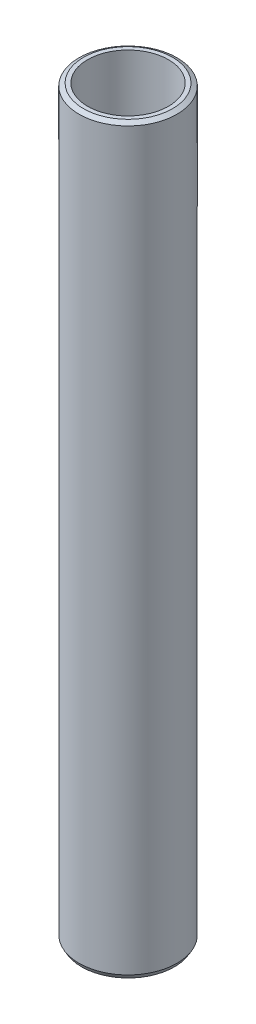
ISO-10303-21;
HEADER;
FILE_DESCRIPTION(('STEP AP214'),'2;1');
FILE_NAME('part.step','',(''),(''),'','','');
FILE_SCHEMA(('AUTOMOTIVE_DESIGN { 1 0 10303 214 1 1 1 1 }'));
ENDSEC;
DATA;
#1=APPLICATION_CONTEXT('core data for automotive mechanical design processes');
#2=APPLICATION_PROTOCOL_DEFINITION('international standard','automotive_design',2000,#1);
#3=PRODUCT_CONTEXT('',#1,'mechanical');
#4=PRODUCT('Part','Part','',(#3));
#5=PRODUCT_RELATED_PRODUCT_CATEGORY('part','',(#4));
#6=PRODUCT_DEFINITION_FORMATION('','',#4);
#7=PRODUCT_DEFINITION_CONTEXT('part definition',#1,'design');
#8=PRODUCT_DEFINITION('design','',#6,#7);
#9=PRODUCT_DEFINITION_SHAPE('','',#8);
#10=(LENGTH_UNIT() NAMED_UNIT(*) SI_UNIT(.MILLI.,.METRE.));
#11=(NAMED_UNIT(*) PLANE_ANGLE_UNIT() SI_UNIT($,.RADIAN.));
#12=(NAMED_UNIT(*) SI_UNIT($,.STERADIAN.) SOLID_ANGLE_UNIT());
#13=UNCERTAINTY_MEASURE_WITH_UNIT(LENGTH_MEASURE(1.E-05),#10,'distance_accuracy_value','');
#14=(GEOMETRIC_REPRESENTATION_CONTEXT(3) GLOBAL_UNCERTAINTY_ASSIGNED_CONTEXT((#13)) GLOBAL_UNIT_ASSIGNED_CONTEXT((#10,
#11,#12)) REPRESENTATION_CONTEXT('',''));
#15=CARTESIAN_POINT('',(0.,0.,0.));
#16=DIRECTION('',(0.,0.,1.));
#17=DIRECTION('',(1.,0.,0.));
#18=AXIS2_PLACEMENT_3D('',#15,#16,#17);
#19=CARTESIAN_POINT('',(0.,378.72117354146,0.));
#20=DIRECTION('',(0.,-1.,0.));
#21=DIRECTION('',(0.,0.,-1.));
#22=AXIS2_PLACEMENT_3D('',#19,#20,#21);
#23=CYLINDRICAL_SURFACE('',#22,25.);
#24=CARTESIAN_POINT('',(0.,377.403934503233,0.));
#25=DIRECTION('',(0.,1.,0.));
#26=DIRECTION('',(0.,0.,1.));
#27=AXIS2_PLACEMENT_3D('',#24,#25,#26);
#28=CIRCLE('',#27,25.);
#29=CARTESIAN_POINT('',(0.,377.403934503233,-25.));
#30=VERTEX_POINT('',#29);
#31=EDGE_CURVE('E50',#30,#30,#28,.F.);
#32=CARTESIAN_POINT('',(0.,2.28152493992373,0.));
#33=DIRECTION('',(0.,1.,0.));
#34=DIRECTION('',(0.,0.,1.));
#35=AXIS2_PLACEMENT_3D('',#32,#33,#34);
#36=CIRCLE('',#35,25.);
#37=CARTESIAN_POINT('',(0.,2.28152493992367,-25.));
#38=VERTEX_POINT('',#37);
#39=EDGE_CURVE('E51',#38,#38,#36,.T.);
#40=CARTESIAN_POINT('',(0.,377.403934503233,-25.));
#41=CARTESIAN_POINT('',(0.,373.496409403615,-25.));
#42=CARTESIAN_POINT('',(0.,369.588884303997,-25.));
#43=CARTESIAN_POINT('',(0.,361.773834104762,-25.));
#44=CARTESIAN_POINT('',(0.,357.866309005144,-25.));
#45=CARTESIAN_POINT('',(0.,350.051258805908,-25.));
#46=CARTESIAN_POINT('',(0.,346.14373370629,-25.));
#47=CARTESIAN_POINT('',(0.,338.328683507055,-25.));
#48=CARTESIAN_POINT('',(0.,334.421158407437,-25.));
#49=CARTESIAN_POINT('',(0.,326.606108208201,-25.));
#50=CARTESIAN_POINT('',(0.,322.698583108584,-25.));
#51=CARTESIAN_POINT('',(0.,314.883532909348,-25.));
#52=CARTESIAN_POINT('',(0.,310.97600780973,-25.));
#53=CARTESIAN_POINT('',(0.,303.160957610495,-25.));
#54=CARTESIAN_POINT('',(0.,299.253432510877,-25.));
#55=CARTESIAN_POINT('',(0.,291.438382311641,-25.));
#56=CARTESIAN_POINT('',(0.,287.530857212023,-25.));
#57=CARTESIAN_POINT('',(0.,279.715807012788,-25.));
#58=CARTESIAN_POINT('',(0.,275.80828191317,-25.));
#59=CARTESIAN_POINT('',(0.,267.993231713934,-25.));
#60=CARTESIAN_POINT('',(0.,264.085706614317,-25.));
#61=CARTESIAN_POINT('',(0.,256.270656415081,-25.));
#62=CARTESIAN_POINT('',(0.,252.363131315463,-25.));
#63=CARTESIAN_POINT('',(0.,244.548081116228,-25.));
#64=CARTESIAN_POINT('',(0.,240.64055601661,-25.));
#65=CARTESIAN_POINT('',(0.,232.825505817374,-25.));
#66=CARTESIAN_POINT('',(0.,228.917980717756,-25.));
#67=CARTESIAN_POINT('',(0.,221.102930518521,-25.));
#68=CARTESIAN_POINT('',(0.,217.195405418903,-25.));
#69=CARTESIAN_POINT('',(0.,209.380355219667,-25.));
#70=CARTESIAN_POINT('',(0.,205.472830120049,-25.));
#71=CARTESIAN_POINT('',(0.,197.657779920814,-25.));
#72=CARTESIAN_POINT('',(0.,193.750254821196,-25.));
#73=CARTESIAN_POINT('',(0.,185.93520462196,-25.));
#74=CARTESIAN_POINT('',(0.,182.027679522343,-25.));
#75=CARTESIAN_POINT('',(0.,174.212629323107,-25.));
#76=CARTESIAN_POINT('',(0.,170.305104223489,-25.));
#77=CARTESIAN_POINT('',(0.,162.490054024254,-25.));
#78=CARTESIAN_POINT('',(0.,158.582528924636,-25.));
#79=CARTESIAN_POINT('',(0.,150.7674787254,-25.));
#80=CARTESIAN_POINT('',(0.,146.859953625782,-25.));
#81=CARTESIAN_POINT('',(0.,139.044903426547,-25.));
#82=CARTESIAN_POINT('',(0.,135.137378326929,-25.));
#83=CARTESIAN_POINT('',(0.,127.322328127693,-25.));
#84=CARTESIAN_POINT('',(0.,123.414803028076,-25.));
#85=CARTESIAN_POINT('',(0.,115.59975282884,-25.));
#86=CARTESIAN_POINT('',(0.,111.692227729222,-25.));
#87=CARTESIAN_POINT('',(0.,103.877177529987,-25.));
#88=CARTESIAN_POINT('',(0.,99.9696524303688,-25.));
#89=CARTESIAN_POINT('',(0.,92.1546022311332,-25.));
#90=CARTESIAN_POINT('',(0.,88.2470771315154,-25.));
#91=CARTESIAN_POINT('',(0.,80.4320269322798,-25.));
#92=CARTESIAN_POINT('',(0.,76.524501832662,-25.));
#93=CARTESIAN_POINT('',(0.,68.7094516334263,-25.));
#94=CARTESIAN_POINT('',(0.,64.8019265338085,-25.));
#95=CARTESIAN_POINT('',(0.,56.9868763345729,-25.));
#96=CARTESIAN_POINT('',(0.,53.0793512349551,-25.));
#97=CARTESIAN_POINT('',(0.,45.2643010357195,-25.));
#98=CARTESIAN_POINT('',(0.,41.3567759361017,-25.));
#99=CARTESIAN_POINT('',(0.,33.5417257368661,-25.));
#100=CARTESIAN_POINT('',(0.,29.6342006372483,-25.));
#101=CARTESIAN_POINT('',(0.,21.8191504380127,-25.));
#102=CARTESIAN_POINT('',(0.,17.9116253383949,-25.));
#103=CARTESIAN_POINT('',(0.,10.0965751391593,-25.));
#104=CARTESIAN_POINT('',(0.,6.18905003954147,-25.));
#105=CARTESIAN_POINT('',(0.,2.28152493992367,-25.));
#106=B_SPLINE_CURVE_WITH_KNOTS('',3,(#40,#41,#42,#43,#44,#45,#46,#47,#48,#49,#50,#51,#52,#53,
#54,#55,#56,#57,#58,#59,#60,#61,#62,#63,#64,#65,#66,#67,#68,#69,#70,#71,#72,#73,#74,#75,#76,#77,
#78,#79,#80,#81,#82,#83,#84,#85,#86,#87,#88,#89,#90,#91,#92,#93,#94,#95,#96,#97,#98,#99,#100,
#101,#102,#103,#104,#105),.UNSPECIFIED.,.F.,.F.,(4,2,2,2,2,2,2,2,2,2,2,2,2,2,2,2,2,2,2,2,2,2,2,
2,2,2,2,2,2,2,2,2,4),(0.,11.7225752988534,23.4451505977068,35.1677258965602,46.8903011954136,
58.612876494267,70.3354517931205,82.0580270919739,93.7806023908273,105.503177689681,
117.225752988534,128.948328287387,140.670903586241,152.393478885094,164.116054183948,
175.838629482801,187.561204781655,199.283780080508,211.006355379361,222.728930678215,
234.451505977068,246.174081275922,257.896656574775,269.619231873628,281.341807172482,
293.064382471335,304.786957770189,316.509533069042,328.232108367895,339.954683666749,
351.677258965602,363.399834264456,375.122409563309),.UNSPECIFIED.);
#107=EDGE_CURVE('BSEAM39',#30,#38,#106,.T.);
#108=ORIENTED_EDGE('',*,*,#31,.T.);
#109=ORIENTED_EDGE('',*,*,#39,.T.);
#110=ORIENTED_EDGE('',*,*,#107,.T.);
#111=ORIENTED_EDGE('',*,*,#107,.F.);
#112=EDGE_LOOP('',(#108,#110,#109,#111));
#113=FACE_BOUND('',#112,.T.);
#114=ADVANCED_FACE('F39',(#113),#23,.T.);
#115=CARTESIAN_POINT('',(0.,378.72117354146,0.));
#116=DIRECTION('',(0.,1.,0.));
#117=DIRECTION('',(0.,0.,1.));
#118=AXIS2_PLACEMENT_3D('',#115,#116,#117);
#119=PLANE('',#118);
#120=CARTESIAN_POINT('',(0.,378.72117354146,0.));
#121=DIRECTION('',(0.,1.,0.));
#122=DIRECTION('',(0.,0.,1.));
#123=AXIS2_PLACEMENT_3D('',#120,#121,#122);
#124=CIRCLE('',#123,22.7184750600773);
#125=CARTESIAN_POINT('',(0.,378.72117354146,-22.7184750600773));
#126=VERTEX_POINT('',#125);
#127=EDGE_CURVE('E54',#126,#126,#124,.T.);
#128=ORIENTED_EDGE('',*,*,#127,.T.);
#129=EDGE_LOOP('',(#128));
#130=FACE_BOUND('',#129,.T.);
#131=CARTESIAN_POINT('',(0.,378.72117354146,0.));
#132=DIRECTION('',(0.,1.,0.));
#133=DIRECTION('',(0.,0.,1.));
#134=AXIS2_PLACEMENT_3D('',#131,#132,#133);
#135=CIRCLE('',#134,20.6359579126317);
#136=CARTESIAN_POINT('',(0.,378.72117354146,-20.6359579126317));
#137=VERTEX_POINT('',#136);
#138=EDGE_CURVE('E58',#137,#137,#135,.T.);
#139=ORIENTED_EDGE('',*,*,#138,.F.);
#140=EDGE_LOOP('',(#139));
#141=FACE_BOUND('',#140,.T.);
#142=ADVANCED_FACE('F69',(#130,#141),#119,.T.);
#143=CARTESIAN_POINT('',(0.,0.,0.));
#144=DIRECTION('',(0.,1.,0.));
#145=DIRECTION('',(0.,0.,1.));
#146=AXIS2_PLACEMENT_3D('',#143,#144,#145);
#147=PLANE('',#146);
#148=CARTESIAN_POINT('',(0.,0.,0.));
#149=DIRECTION('',(0.,1.,0.));
#150=DIRECTION('',(0.,0.,1.));
#151=AXIS2_PLACEMENT_3D('',#148,#149,#150);
#152=CIRCLE('',#151,23.6827609617722);
#153=CARTESIAN_POINT('',(0.,0.,23.6827609617722));
#154=VERTEX_POINT('',#153);
#155=EDGE_CURVE('E10',#154,#154,#152,.F.);
#156=ORIENTED_EDGE('',*,*,#155,.T.);
#157=EDGE_LOOP('',(#156));
#158=FACE_BOUND('',#157,.T.);
#159=CARTESIAN_POINT('',(0.,0.,0.));
#160=DIRECTION('',(0.,1.,0.));
#161=DIRECTION('',(0.,0.,1.));
#162=AXIS2_PLACEMENT_3D('',#159,#160,#161);
#163=CIRCLE('',#162,20.6359579126317);
#164=CARTESIAN_POINT('',(0.,0.,-20.6359579126317));
#165=VERTEX_POINT('',#164);
#166=EDGE_CURVE('E63',#165,#165,#163,.T.);
#167=ORIENTED_EDGE('',*,*,#166,.T.);
#168=EDGE_LOOP('',(#167));
#169=FACE_BOUND('',#168,.T.);
#170=ADVANCED_FACE('F75',(#158,#169),#147,.F.);
#171=CARTESIAN_POINT('',(0.,378.72117354146,0.));
#172=DIRECTION('',(0.,-1.,0.));
#173=DIRECTION('',(0.,0.,-1.));
#174=AXIS2_PLACEMENT_3D('',#171,#172,#173);
#175=CYLINDRICAL_SURFACE('',#174,20.6359579126317);
#176=CARTESIAN_POINT('',(0.,378.72117354146,-20.6359579126317));
#177=CARTESIAN_POINT('',(0.,374.77616131707,-20.6359579126317));
#178=CARTESIAN_POINT('',(0.,370.83114909268,-20.6359579126317));
#179=CARTESIAN_POINT('',(0.,362.941124643899,-20.6359579126317));
#180=CARTESIAN_POINT('',(0.,358.996112419509,-20.6359579126317));
#181=CARTESIAN_POINT('',(0.,351.106087970729,-20.6359579126317));
#182=CARTESIAN_POINT('',(0.,347.161075746338,-20.6359579126317));
#183=CARTESIAN_POINT('',(0.,339.271051297558,-20.6359579126317));
#184=CARTESIAN_POINT('',(0.,335.326039073168,-20.6359579126317));
#185=CARTESIAN_POINT('',(0.,327.436014624387,-20.6359579126317));
#186=CARTESIAN_POINT('',(0.,323.491002399997,-20.6359579126317));
#187=CARTESIAN_POINT('',(0.,315.600977951217,-20.6359579126317));
#188=CARTESIAN_POINT('',(0.,311.655965726826,-20.6359579126317));
#189=CARTESIAN_POINT('',(0.,303.765941278046,-20.6359579126317));
#190=CARTESIAN_POINT('',(0.,299.820929053656,-20.6359579126317));
#191=CARTESIAN_POINT('',(0.,291.930904604875,-20.6359579126317));
#192=CARTESIAN_POINT('',(0.,287.985892380485,-20.6359579126317));
#193=CARTESIAN_POINT('',(0.,280.095867931705,-20.6359579126317));
#194=CARTESIAN_POINT('',(0.,276.150855707315,-20.6359579126317));
#195=CARTESIAN_POINT('',(0.,268.260831258534,-20.6359579126317));
#196=CARTESIAN_POINT('',(0.,264.315819034144,-20.6359579126317));
#197=CARTESIAN_POINT('',(0.,256.425794585364,-20.6359579126317));
#198=CARTESIAN_POINT('',(0.,252.480782360973,-20.6359579126317));
#199=CARTESIAN_POINT('',(0.,244.590757912193,-20.6359579126317));
#200=CARTESIAN_POINT('',(0.,240.645745687803,-20.6359579126317));
#201=CARTESIAN_POINT('',(0.,232.755721239022,-20.6359579126317));
#202=CARTESIAN_POINT('',(0.,228.810709014632,-20.6359579126317));
#203=CARTESIAN_POINT('',(0.,220.920684565852,-20.6359579126317));
#204=CARTESIAN_POINT('',(0.,216.975672341461,-20.6359579126317));
#205=CARTESIAN_POINT('',(0.,209.085647892681,-20.6359579126317));
#206=CARTESIAN_POINT('',(0.,205.140635668291,-20.6359579126317));
#207=CARTESIAN_POINT('',(0.,197.25061121951,-20.6359579126317));
#208=CARTESIAN_POINT('',(0.,193.30559899512,-20.6359579126317));
#209=CARTESIAN_POINT('',(0.,185.41557454634,-20.6359579126317));
#210=CARTESIAN_POINT('',(0.,181.47056232195,-20.6359579126317));
#211=CARTESIAN_POINT('',(0.,173.580537873169,-20.6359579126317));
#212=CARTESIAN_POINT('',(0.,169.635525648779,-20.6359579126317));
#213=CARTESIAN_POINT('',(0.,161.745501199999,-20.6359579126317));
#214=CARTESIAN_POINT('',(0.,157.800488975608,-20.6359579126317));
#215=CARTESIAN_POINT('',(0.,149.910464526828,-20.6359579126317));
#216=CARTESIAN_POINT('',(0.,145.965452302438,-20.6359579126317));
#217=CARTESIAN_POINT('',(0.,138.075427853657,-20.6359579126317));
#218=CARTESIAN_POINT('',(0.,134.130415629267,-20.6359579126317));
#219=CARTESIAN_POINT('',(0.,126.240391180487,-20.6359579126317));
#220=CARTESIAN_POINT('',(0.,122.295378956096,-20.6359579126317));
#221=CARTESIAN_POINT('',(0.,114.405354507316,-20.6359579126317));
#222=CARTESIAN_POINT('',(0.,110.460342282926,-20.6359579126317));
#223=CARTESIAN_POINT('',(0.,102.570317834145,-20.6359579126317));
#224=CARTESIAN_POINT('',(0.,98.6253056097552,-20.6359579126317));
#225=CARTESIAN_POINT('',(0.,90.7352811609748,-20.6359579126317));
#226=CARTESIAN_POINT('',(0.,86.7902689365846,-20.6359579126317));
#227=CARTESIAN_POINT('',(0.,78.9002444878041,-20.6359579126317));
#228=CARTESIAN_POINT('',(0.,74.9552322634139,-20.6359579126317));
#229=CARTESIAN_POINT('',(0.,67.0652078146335,-20.6359579126317));
#230=CARTESIAN_POINT('',(0.,63.1201955902433,-20.6359579126317));
#231=CARTESIAN_POINT('',(0.,55.2301711414629,-20.6359579126317));
#232=CARTESIAN_POINT('',(0.,51.2851589170727,-20.6359579126317));
#233=CARTESIAN_POINT('',(0.,43.3951344682922,-20.6359579126317));
#234=CARTESIAN_POINT('',(0.,39.450122243902,-20.6359579126317));
#235=CARTESIAN_POINT('',(0.,31.5600977951216,-20.6359579126317));
#236=CARTESIAN_POINT('',(0.,27.6150855707314,-20.6359579126317));
#237=CARTESIAN_POINT('',(0.,19.725061121951,-20.6359579126317));
#238=CARTESIAN_POINT('',(0.,15.7800488975608,-20.6359579126317));
#239=CARTESIAN_POINT('',(0.,7.89002444878038,-20.6359579126317));
#240=CARTESIAN_POINT('',(0.,3.94501222439016,-20.6359579126317));
#241=CARTESIAN_POINT('',(0.,0.,-20.6359579126317));
#242=B_SPLINE_CURVE_WITH_KNOTS('',3,(#176,#177,#178,#179,#180,#181,#182,#183,#184,#185,#186,
#187,#188,#189,#190,#191,#192,#193,#194,#195,#196,#197,#198,#199,#200,#201,#202,#203,#204,#205,
#206,#207,#208,#209,#210,#211,#212,#213,#214,#215,#216,#217,#218,#219,#220,#221,#222,#223,#224,
#225,#226,#227,#228,#229,#230,#231,#232,#233,#234,#235,#236,#237,#238,#239,#240,#241),
.UNSPECIFIED.,.F.,.F.,(4,2,2,2,2,2,2,2,2,2,2,2,2,2,2,2,2,2,2,2,2,2,2,2,2,2,2,2,2,2,2,2,4),(0.,
11.8350366731707,23.6700733463413,35.5051100195119,47.3401466926826,59.1751833658531,
71.0102200390238,82.8452567121944,94.680293385365,106.515330058536,118.350366731706,
130.185403404877,142.020440078048,153.855476751218,165.690513424389,177.525550097559,
189.36058677073,201.195623443901,213.030660117071,224.865696790242,236.700733463413,
248.535770136583,260.370806809754,272.205843482924,284.040880156095,295.875916829266,
307.710953502436,319.545990175607,331.381026848778,343.216063521948,355.051100195119,
366.886136868289,378.72117354146),.UNSPECIFIED.);
#243=EDGE_CURVE('BSEAM70',#137,#165,#242,.T.);
#244=ORIENTED_EDGE('',*,*,#138,.T.);
#245=ORIENTED_EDGE('',*,*,#166,.F.);
#246=ORIENTED_EDGE('',*,*,#243,.T.);
#247=ORIENTED_EDGE('',*,*,#243,.F.);
#248=EDGE_LOOP('',(#244,#246,#245,#247));
#249=FACE_BOUND('',#248,.T.);
#250=ADVANCED_FACE('F70',(#249),#175,.F.);
#251=CARTESIAN_POINT('',(0.,378.72117354146,0.));
#252=DIRECTION('',(0.,-1.,0.));
#253=DIRECTION('',(0.,0.,-1.));
#254=AXIS2_PLACEMENT_3D('',#251,#252,#253);
#255=CONICAL_SURFACE('',#254,22.7184750600773,1.0471975511966);
#256=CARTESIAN_POINT('',(0.,377.403934503233,-25.));
#257=CARTESIAN_POINT('',(0.,377.417655743214,-24.9762341152092));
#258=CARTESIAN_POINT('',(0.,377.431376983196,-24.9524682304183));
#259=CARTESIAN_POINT('',(0.,377.458819463159,-24.9049364608366));
#260=CARTESIAN_POINT('',(0.,377.47254070314,-24.8811705760457));
#261=CARTESIAN_POINT('',(0.,377.499983183104,-24.833638806464));
#262=CARTESIAN_POINT('',(0.,377.513704423085,-24.8098729216732));
#263=CARTESIAN_POINT('',(0.,377.541146903048,-24.7623411520914));
#264=CARTESIAN_POINT('',(0.,377.55486814303,-24.7385752673006));
#265=CARTESIAN_POINT('',(0.,377.582310622993,-24.6910434977188));
#266=CARTESIAN_POINT('',(0.,377.596031862974,-24.667277612928));
#267=CARTESIAN_POINT('',(0.,377.623474342937,-24.6197458433463));
#268=CARTESIAN_POINT('',(0.,377.637195582919,-24.5959799585554));
#269=CARTESIAN_POINT('',(0.,377.664638062882,-24.5484481889737));
#270=CARTESIAN_POINT('',(0.,377.678359302863,-24.5246823041828));
#271=CARTESIAN_POINT('',(0.,377.705801782827,-24.4771505346011));
#272=CARTESIAN_POINT('',(0.,377.719523022808,-24.4533846498102));
#273=CARTESIAN_POINT('',(0.,377.746965502771,-24.4058528802285));
#274=CARTESIAN_POINT('',(0.,377.760686742753,-24.3820869954376));
#275=CARTESIAN_POINT('',(0.,377.788129222716,-24.3345552258559));
#276=CARTESIAN_POINT('',(0.,377.801850462697,-24.3107893410651));
#277=CARTESIAN_POINT('',(0.,377.82929294266,-24.2632575714833));
#278=CARTESIAN_POINT('',(0.,377.843014182642,-24.2394916866925));
#279=CARTESIAN_POINT('',(0.,377.870456662605,-24.1919599171108));
#280=CARTESIAN_POINT('',(0.,377.884177902586,-24.1681940323199));
#281=CARTESIAN_POINT('',(0.,377.91162038255,-24.1206622627382));
#282=CARTESIAN_POINT('',(0.,377.925341622531,-24.0968963779473));
#283=CARTESIAN_POINT('',(0.,377.952784102494,-24.0493646083656));
#284=CARTESIAN_POINT('',(0.,377.966505342476,-24.0255987235747));
#285=CARTESIAN_POINT('',(0.,377.993947822439,-23.978066953993));
#286=CARTESIAN_POINT('',(0.,378.00766906242,-23.9543010692021));
#287=CARTESIAN_POINT('',(0.,378.035111542383,-23.9067692996204));
#288=CARTESIAN_POINT('',(0.,378.048832782365,-23.8830034148295));
#289=CARTESIAN_POINT('',(0.,378.076275262328,-23.8354716452478));
#290=CARTESIAN_POINT('',(0.,378.089996502309,-23.811705760457));
#291=CARTESIAN_POINT('',(0.,378.117438982273,-23.7641739908752));
#292=CARTESIAN_POINT('',(0.,378.131160222254,-23.7404081060844));
#293=CARTESIAN_POINT('',(0.,378.158602702217,-23.6928763365027));
#294=CARTESIAN_POINT('',(0.,378.172323942199,-23.6691104517118));
#295=CARTESIAN_POINT('',(0.,378.199766422162,-23.6215786821301));
#296=CARTESIAN_POINT('',(0.,378.213487662143,-23.5978127973392));
#297=CARTESIAN_POINT('',(0.,378.240930142106,-23.5502810277575));
#298=CARTESIAN_POINT('',(0.,378.254651382088,-23.5265151429666));
#299=CARTESIAN_POINT('',(0.,378.282093862051,-23.4789833733849));
#300=CARTESIAN_POINT('',(0.,378.295815102032,-23.455217488594));
#301=CARTESIAN_POINT('',(0.,378.323257581996,-23.4076857190123));
#302=CARTESIAN_POINT('',(0.,378.336978821977,-23.3839198342215));
#303=CARTESIAN_POINT('',(0.,378.36442130194,-23.3363880646397));
#304=CARTESIAN_POINT('',(0.,378.378142541922,-23.3126221798489));
#305=CARTESIAN_POINT('',(0.,378.405585021885,-23.2650904102672));
#306=CARTESIAN_POINT('',(0.,378.419306261866,-23.2413245254763));
#307=CARTESIAN_POINT('',(0.,378.446748741829,-23.1937927558946));
#308=CARTESIAN_POINT('',(0.,378.460469981811,-23.1700268711037));
#309=CARTESIAN_POINT('',(0.,378.487912461774,-23.122495101522));
#310=CARTESIAN_POINT('',(0.,378.501633701756,-23.0987292167311));
#311=CARTESIAN_POINT('',(0.,378.529076181719,-23.0511974471494));
#312=CARTESIAN_POINT('',(0.,378.5427974217,-23.0274315623585));
#313=CARTESIAN_POINT('',(0.,378.570239901663,-22.9798997927768));
#314=CARTESIAN_POINT('',(0.,378.583961141645,-22.9561339079859));
#315=CARTESIAN_POINT('',(0.,378.611403621608,-22.9086021384042));
#316=CARTESIAN_POINT('',(0.,378.625124861589,-22.8848362536134));
#317=CARTESIAN_POINT('',(0.,378.652567341552,-22.8373044840316));
#318=CARTESIAN_POINT('',(0.,378.666288581534,-22.8135385992408));
#319=CARTESIAN_POINT('',(0.,378.693731061497,-22.7660068296591));
#320=CARTESIAN_POINT('',(0.,378.707452301478,-22.7422409448682));
#321=CARTESIAN_POINT('',(0.,378.72117354146,-22.7184750600773));
#322=B_SPLINE_CURVE_WITH_KNOTS('',3,(#256,#257,#258,#259,#260,#261,#262,#263,#264,#265,#266,
#267,#268,#269,#270,#271,#272,#273,#274,#275,#276,#277,#278,#279,#280,#281,#282,#283,#284,#285,
#286,#287,#288,#289,#290,#291,#292,#293,#294,#295,#296,#297,#298,#299,#300,#301,#302,#303,#304,
#305,#306,#307,#308,#309,#310,#311,#312,#313,#314,#315,#316,#317,#318,#319,#320,#321),
.UNSPECIFIED.,.F.,.F.,(4,2,2,2,2,2,2,2,2,2,2,2,2,2,2,2,2,2,2,2,2,2,2,2,2,2,2,2,2,2,2,2,4),(0.,
0.0823274398892089,0.164654879778418,0.246982319667624,0.329309759556805,0.411637199446014,
0.493964639335222,0.576292079224431,0.658619519113613,0.740946959002821,0.823274398892027,
0.905601838781236,0.987929278670417,1.07025671855963,1.15258415844884,1.23491159833804,
1.31723903822723,1.39956647811643,1.48189391800564,1.56422135789485,1.64654879778403,
1.72887623767324,1.81120367756245,1.89353111745166,1.97585855734086,2.05818599723004,
2.14051343711925,2.22284087700846,2.30516831689767,2.38749575678685,2.46982319667606,
2.55215063656527,2.63447807645448),.UNSPECIFIED.);
#323=EDGE_CURVE('BSEAM81',#30,#126,#322,.T.);
#324=ORIENTED_EDGE('',*,*,#31,.F.);
#325=ORIENTED_EDGE('',*,*,#127,.F.);
#326=ORIENTED_EDGE('',*,*,#323,.T.);
#327=ORIENTED_EDGE('',*,*,#323,.F.);
#328=EDGE_LOOP('',(#324,#326,#325,#327));
#329=FACE_BOUND('',#328,.T.);
#330=ADVANCED_FACE('F81',(#329),#255,.T.);
#331=CARTESIAN_POINT('',(0.,2.28152493992373,0.));
#332=DIRECTION('',(0.,1.,0.));
#333=DIRECTION('',(0.,0.,1.));
#334=AXIS2_PLACEMENT_3D('',#331,#332,#333);
#335=CONICAL_SURFACE('',#334,25.,0.523598775598312);
#336=ORIENTED_EDGE('',*,*,#155,.F.);
#337=EDGE_LOOP('',(#336));
#338=FACE_BOUND('',#337,.T.);
#339=ORIENTED_EDGE('',*,*,#39,.F.);
#340=EDGE_LOOP('',(#339));
#341=FACE_BOUND('',#340,.T.);
#342=ADVANCED_FACE('F45',(#338,#341),#335,.T.);
#343=CLOSED_SHELL('',(#114,#142,#170,#250,#330,#342));
#344=MANIFOLD_SOLID_BREP('B2',#343);
#345=ADVANCED_BREP_SHAPE_REPRESENTATION('',(#18,#344),#14);
#346=SHAPE_DEFINITION_REPRESENTATION(#9,#345);
ENDSEC;
END-ISO-10303-21;
